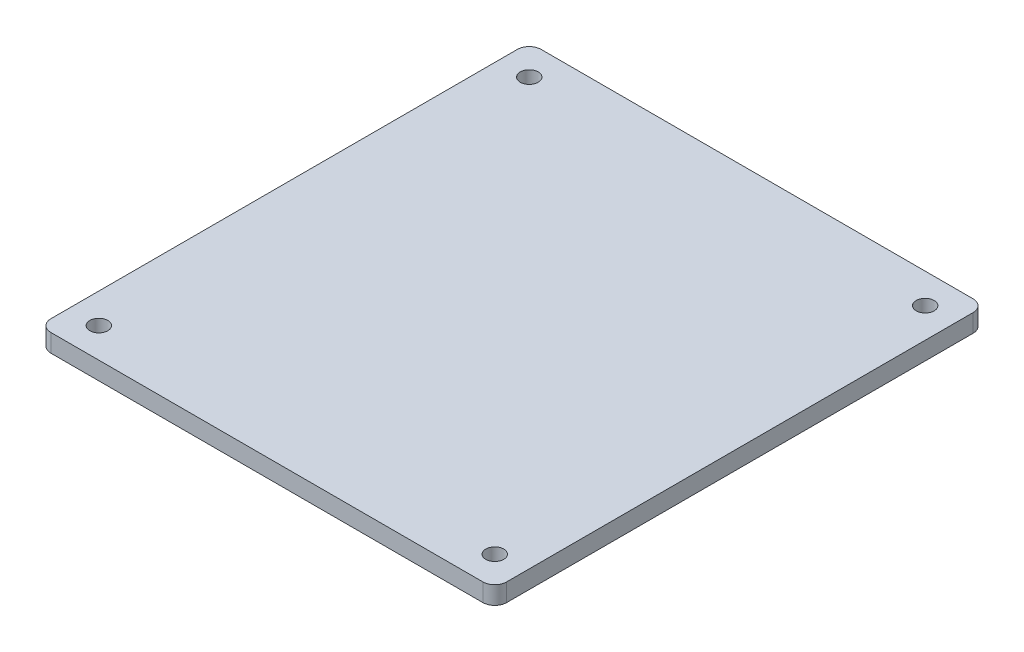
ISO-10303-21;
HEADER;
FILE_DESCRIPTION(('STEP AP214'),'2;1');
FILE_NAME('part.step','',(''),(''),'','','');
FILE_SCHEMA(('AUTOMOTIVE_DESIGN { 1 0 10303 214 1 1 1 1 }'));
ENDSEC;
DATA;
#1=APPLICATION_CONTEXT('core data for automotive mechanical design processes');
#2=APPLICATION_PROTOCOL_DEFINITION('international standard','automotive_design',2000,#1);
#3=PRODUCT_CONTEXT('',#1,'mechanical');
#4=PRODUCT('Part','Part','',(#3));
#5=PRODUCT_RELATED_PRODUCT_CATEGORY('part','',(#4));
#6=PRODUCT_DEFINITION_FORMATION('','',#4);
#7=PRODUCT_DEFINITION_CONTEXT('part definition',#1,'design');
#8=PRODUCT_DEFINITION('design','',#6,#7);
#9=PRODUCT_DEFINITION_SHAPE('','',#8);
#10=(LENGTH_UNIT() NAMED_UNIT(*) SI_UNIT(.MILLI.,.METRE.));
#11=(NAMED_UNIT(*) PLANE_ANGLE_UNIT() SI_UNIT($,.RADIAN.));
#12=(NAMED_UNIT(*) SI_UNIT($,.STERADIAN.) SOLID_ANGLE_UNIT());
#13=UNCERTAINTY_MEASURE_WITH_UNIT(LENGTH_MEASURE(1.E-05),#10,'distance_accuracy_value','');
#14=(GEOMETRIC_REPRESENTATION_CONTEXT(3) GLOBAL_UNCERTAINTY_ASSIGNED_CONTEXT((#13)) GLOBAL_UNIT_ASSIGNED_CONTEXT((#10,
#11,#12)) REPRESENTATION_CONTEXT('',''));
#15=CARTESIAN_POINT('',(0.,0.,0.));
#16=DIRECTION('',(0.,0.,1.));
#17=DIRECTION('',(1.,0.,0.));
#18=AXIS2_PLACEMENT_3D('',#15,#16,#17);
#19=CARTESIAN_POINT('',(1.5875,2.38125,-1.5875));
#20=DIRECTION('',(0.,-1.,0.));
#21=DIRECTION('',(0.,0.,-1.));
#22=AXIS2_PLACEMENT_3D('',#19,#20,#21);
#23=PLANE('',#22);
#24=CARTESIAN_POINT('',(1.5875,2.38125,-1.5875));
#25=DIRECTION('',(0.,1.,0.));
#26=DIRECTION('',(0.,0.,-1.));
#27=AXIS2_PLACEMENT_3D('',#24,#25,#26);
#28=CIRCLE('',#27,1.5875);
#29=CARTESIAN_POINT('',(0.,2.38125,-1.58750000000001));
#30=VERTEX_POINT('',#29);
#31=CARTESIAN_POINT('',(1.58750000000001,2.38125,0.));
#32=VERTEX_POINT('',#31);
#33=EDGE_CURVE('E168',#30,#32,#28,.T.);
#34=ORIENTED_EDGE('',*,*,#33,.T.);
#35=DIRECTION('',(1.,0.,0.));
#36=VECTOR('',#35,1.);
#37=CARTESIAN_POINT('',(1.58750000000001,2.38125,0.));
#38=LINE('',#37,#36);
#39=CARTESIAN_POINT('',(58.8645,2.38125,0.));
#40=VERTEX_POINT('',#39);
#41=EDGE_CURVE('E104',#32,#40,#38,.T.);
#42=ORIENTED_EDGE('',*,*,#41,.T.);
#43=CARTESIAN_POINT('',(58.8645,2.38125,-1.5875));
#44=DIRECTION('',(0.,1.,0.));
#45=DIRECTION('',(0.,0.,-1.));
#46=AXIS2_PLACEMENT_3D('',#43,#44,#45);
#47=CIRCLE('',#46,1.5875);
#48=CARTESIAN_POINT('',(60.452,2.38125,-1.58750000000001));
#49=VERTEX_POINT('',#48);
#50=EDGE_CURVE('E189',#40,#49,#47,.T.);
#51=ORIENTED_EDGE('',*,*,#50,.T.);
#52=DIRECTION('',(0.,0.,-1.));
#53=VECTOR('',#52,1.);
#54=CARTESIAN_POINT('',(60.452,2.38125,-1.58750000000001));
#55=LINE('',#54,#53);
#56=CARTESIAN_POINT('',(60.452,2.38125,-63.4365));
#57=VERTEX_POINT('',#56);
#58=EDGE_CURVE('E203',#49,#57,#55,.T.);
#59=ORIENTED_EDGE('',*,*,#58,.T.);
#60=CARTESIAN_POINT('',(58.8645,2.38125,-63.4365));
#61=DIRECTION('',(0.,1.,0.));
#62=DIRECTION('',(0.,0.,1.));
#63=AXIS2_PLACEMENT_3D('',#60,#61,#62);
#64=CIRCLE('',#63,1.5875);
#65=CARTESIAN_POINT('',(58.8645,2.38125,-65.024));
#66=VERTEX_POINT('',#65);
#67=EDGE_CURVE('E123',#57,#66,#64,.T.);
#68=ORIENTED_EDGE('',*,*,#67,.T.);
#69=DIRECTION('',(-1.,0.,0.));
#70=VECTOR('',#69,1.);
#71=CARTESIAN_POINT('',(1.58750000000001,2.38125,-65.024));
#72=LINE('',#71,#70);
#73=CARTESIAN_POINT('',(1.58750000000001,2.38125,-65.024));
#74=VERTEX_POINT('',#73);
#75=EDGE_CURVE('E117',#66,#74,#72,.T.);
#76=ORIENTED_EDGE('',*,*,#75,.T.);
#77=CARTESIAN_POINT('',(1.5875,2.38125,-63.4365));
#78=DIRECTION('',(0.,1.,0.));
#79=DIRECTION('',(0.,0.,1.));
#80=AXIS2_PLACEMENT_3D('',#77,#78,#79);
#81=CIRCLE('',#80,1.5875);
#82=CARTESIAN_POINT('',(0.,2.38125,-63.4365));
#83=VERTEX_POINT('',#82);
#84=EDGE_CURVE('E121',#74,#83,#81,.T.);
#85=ORIENTED_EDGE('',*,*,#84,.T.);
#86=DIRECTION('',(0.,0.,1.));
#87=VECTOR('',#86,1.);
#88=CARTESIAN_POINT('',(0.,2.38125,-1.58750000000001));
#89=LINE('',#88,#87);
#90=EDGE_CURVE('E61',#83,#30,#89,.T.);
#91=ORIENTED_EDGE('',*,*,#90,.T.);
#92=EDGE_LOOP('',(#34,#42,#51,#59,#68,#76,#85,#91));
#93=FACE_BOUND('',#92,.T.);
#94=CARTESIAN_POINT('',(3.96875,2.38125,-3.96875));
#95=DIRECTION('',(0.,1.,0.));
#96=DIRECTION('',(0.,0.,1.));
#97=AXIS2_PLACEMENT_3D('',#94,#95,#96);
#98=CIRCLE('',#97,1.190625);
#99=CARTESIAN_POINT('',(3.96875,2.38125,-2.778125));
#100=VERTEX_POINT('',#99);
#101=EDGE_CURVE('E150',#100,#100,#98,.T.);
#102=ORIENTED_EDGE('',*,*,#101,.F.);
#103=EDGE_LOOP('',(#102));
#104=FACE_BOUND('',#103,.T.);
#105=CARTESIAN_POINT('',(3.96875,2.38125,-61.05525));
#106=DIRECTION('',(0.,1.,0.));
#107=DIRECTION('',(0.,0.,1.));
#108=AXIS2_PLACEMENT_3D('',#105,#106,#107);
#109=CIRCLE('',#108,1.190625);
#110=CARTESIAN_POINT('',(3.96875,2.38125,-59.864625));
#111=VERTEX_POINT('',#110);
#112=EDGE_CURVE('E217',#111,#111,#109,.T.);
#113=ORIENTED_EDGE('',*,*,#112,.F.);
#114=EDGE_LOOP('',(#113));
#115=FACE_BOUND('',#114,.T.);
#116=CARTESIAN_POINT('',(56.48325,2.38125,-61.05525));
#117=DIRECTION('',(0.,1.,0.));
#118=DIRECTION('',(0.,0.,1.));
#119=AXIS2_PLACEMENT_3D('',#116,#117,#118);
#120=CIRCLE('',#119,1.190625);
#121=CARTESIAN_POINT('',(56.48325,2.38125,-59.864625));
#122=VERTEX_POINT('',#121);
#123=EDGE_CURVE('E225',#122,#122,#120,.T.);
#124=ORIENTED_EDGE('',*,*,#123,.F.);
#125=EDGE_LOOP('',(#124));
#126=FACE_BOUND('',#125,.T.);
#127=CARTESIAN_POINT('',(56.48325,2.38125,-3.96875));
#128=DIRECTION('',(0.,1.,0.));
#129=DIRECTION('',(0.,0.,1.));
#130=AXIS2_PLACEMENT_3D('',#127,#128,#129);
#131=CIRCLE('',#130,1.190625);
#132=CARTESIAN_POINT('',(56.48325,2.38125,-2.778125));
#133=VERTEX_POINT('',#132);
#134=EDGE_CURVE('E233',#133,#133,#131,.T.);
#135=ORIENTED_EDGE('',*,*,#134,.F.);
#136=EDGE_LOOP('',(#135));
#137=FACE_BOUND('',#136,.T.);
#138=ADVANCED_FACE('F43',(#93,#104,#115,#126,#137),#23,.F.);
#139=CARTESIAN_POINT('',(1.5875,0.,-1.5875));
#140=DIRECTION('',(0.,-1.,0.));
#141=DIRECTION('',(0.,0.,-1.));
#142=AXIS2_PLACEMENT_3D('',#139,#140,#141);
#143=PLANE('',#142);
#144=CARTESIAN_POINT('',(56.48325,0.,-61.05525));
#145=DIRECTION('',(0.,1.,0.));
#146=DIRECTION('',(0.,0.,1.));
#147=AXIS2_PLACEMENT_3D('',#144,#145,#146);
#148=CIRCLE('',#147,1.190625);
#149=CARTESIAN_POINT('',(56.48325,0.,-59.864625));
#150=VERTEX_POINT('',#149);
#151=EDGE_CURVE('E229',#150,#150,#148,.T.);
#152=ORIENTED_EDGE('',*,*,#151,.T.);
#153=EDGE_LOOP('',(#152));
#154=FACE_BOUND('',#153,.T.);
#155=CARTESIAN_POINT('',(3.96875,0.,-3.96875));
#156=DIRECTION('',(0.,1.,0.));
#157=DIRECTION('',(0.,0.,1.));
#158=AXIS2_PLACEMENT_3D('',#155,#156,#157);
#159=CIRCLE('',#158,1.190625);
#160=CARTESIAN_POINT('',(3.96875,0.,-2.778125));
#161=VERTEX_POINT('',#160);
#162=EDGE_CURVE('E213',#161,#161,#159,.T.);
#163=ORIENTED_EDGE('',*,*,#162,.T.);
#164=EDGE_LOOP('',(#163));
#165=FACE_BOUND('',#164,.T.);
#166=CARTESIAN_POINT('',(1.5875,0.,-1.5875));
#167=DIRECTION('',(0.,1.,0.));
#168=DIRECTION('',(0.,0.,-1.));
#169=AXIS2_PLACEMENT_3D('',#166,#167,#168);
#170=CIRCLE('',#169,1.5875);
#171=CARTESIAN_POINT('',(0.,0.,-1.58750000000001));
#172=VERTEX_POINT('',#171);
#173=CARTESIAN_POINT('',(1.58750000000001,0.,0.));
#174=VERTEX_POINT('',#173);
#175=EDGE_CURVE('E145',#172,#174,#170,.T.);
#176=ORIENTED_EDGE('',*,*,#175,.F.);
#177=DIRECTION('',(0.,0.,1.));
#178=VECTOR('',#177,1.);
#179=CARTESIAN_POINT('',(0.,0.,-1.58750000000001));
#180=LINE('',#179,#178);
#181=CARTESIAN_POINT('',(0.,0.,-63.4365));
#182=VERTEX_POINT('',#181);
#183=EDGE_CURVE('E96',#182,#172,#180,.T.);
#184=ORIENTED_EDGE('',*,*,#183,.F.);
#185=CARTESIAN_POINT('',(1.5875,0.,-63.4365));
#186=DIRECTION('',(0.,1.,0.));
#187=DIRECTION('',(0.,0.,1.));
#188=AXIS2_PLACEMENT_3D('',#185,#186,#187);
#189=CIRCLE('',#188,1.5875);
#190=CARTESIAN_POINT('',(1.58750000000001,0.,-65.024));
#191=VERTEX_POINT('',#190);
#192=EDGE_CURVE('E90',#191,#182,#189,.T.);
#193=ORIENTED_EDGE('',*,*,#192,.F.);
#194=DIRECTION('',(-1.,0.,0.));
#195=VECTOR('',#194,1.);
#196=CARTESIAN_POINT('',(1.58750000000001,0.,-65.024));
#197=LINE('',#196,#195);
#198=CARTESIAN_POINT('',(58.8645,0.,-65.024));
#199=VERTEX_POINT('',#198);
#200=EDGE_CURVE('E132',#199,#191,#197,.T.);
#201=ORIENTED_EDGE('',*,*,#200,.F.);
#202=CARTESIAN_POINT('',(58.8645,0.,-63.4365));
#203=DIRECTION('',(0.,1.,0.));
#204=DIRECTION('',(0.,0.,1.));
#205=AXIS2_PLACEMENT_3D('',#202,#203,#204);
#206=CIRCLE('',#205,1.5875);
#207=CARTESIAN_POINT('',(60.452,0.,-63.4365));
#208=VERTEX_POINT('',#207);
#209=EDGE_CURVE('E159',#208,#199,#206,.T.);
#210=ORIENTED_EDGE('',*,*,#209,.F.);
#211=DIRECTION('',(0.,0.,-1.));
#212=VECTOR('',#211,1.);
#213=CARTESIAN_POINT('',(60.452,0.,-1.58750000000001));
#214=LINE('',#213,#212);
#215=CARTESIAN_POINT('',(60.452,0.,-1.58750000000001));
#216=VERTEX_POINT('',#215);
#217=EDGE_CURVE('E156',#216,#208,#214,.T.);
#218=ORIENTED_EDGE('',*,*,#217,.F.);
#219=CARTESIAN_POINT('',(58.8645,0.,-1.5875));
#220=DIRECTION('',(0.,1.,0.));
#221=DIRECTION('',(0.,0.,-1.));
#222=AXIS2_PLACEMENT_3D('',#219,#220,#221);
#223=CIRCLE('',#222,1.5875);
#224=CARTESIAN_POINT('',(58.8645,0.,0.));
#225=VERTEX_POINT('',#224);
#226=EDGE_CURVE('E153',#225,#216,#223,.T.);
#227=ORIENTED_EDGE('',*,*,#226,.F.);
#228=DIRECTION('',(1.,0.,0.));
#229=VECTOR('',#228,1.);
#230=CARTESIAN_POINT('',(1.58750000000001,0.,0.));
#231=LINE('',#230,#229);
#232=EDGE_CURVE('E149',#174,#225,#231,.T.);
#233=ORIENTED_EDGE('',*,*,#232,.F.);
#234=EDGE_LOOP('',(#176,#184,#193,#201,#210,#218,#227,#233));
#235=FACE_BOUND('',#234,.T.);
#236=CARTESIAN_POINT('',(3.96875,0.,-61.05525));
#237=DIRECTION('',(0.,1.,0.));
#238=DIRECTION('',(0.,0.,1.));
#239=AXIS2_PLACEMENT_3D('',#236,#237,#238);
#240=CIRCLE('',#239,1.190625);
#241=CARTESIAN_POINT('',(3.96875,0.,-59.864625));
#242=VERTEX_POINT('',#241);
#243=EDGE_CURVE('E221',#242,#242,#240,.T.);
#244=ORIENTED_EDGE('',*,*,#243,.T.);
#245=EDGE_LOOP('',(#244));
#246=FACE_BOUND('',#245,.T.);
#247=CARTESIAN_POINT('',(56.48325,0.,-3.96875));
#248=DIRECTION('',(0.,1.,0.));
#249=DIRECTION('',(0.,0.,1.));
#250=AXIS2_PLACEMENT_3D('',#247,#248,#249);
#251=CIRCLE('',#250,1.190625);
#252=CARTESIAN_POINT('',(56.48325,0.,-2.778125));
#253=VERTEX_POINT('',#252);
#254=EDGE_CURVE('E237',#253,#253,#251,.T.);
#255=ORIENTED_EDGE('',*,*,#254,.T.);
#256=EDGE_LOOP('',(#255));
#257=FACE_BOUND('',#256,.T.);
#258=ADVANCED_FACE('F193',(#154,#165,#235,#246,#257),#143,.T.);
#259=CARTESIAN_POINT('',(1.5875,2.38125,-1.5875));
#260=DIRECTION('',(0.,-1.,0.));
#261=DIRECTION('',(0.,0.,-1.));
#262=AXIS2_PLACEMENT_3D('',#259,#260,#261);
#263=CYLINDRICAL_SURFACE('',#262,1.5875);
#264=ORIENTED_EDGE('',*,*,#175,.T.);
#265=DIRECTION('',(0.,-1.,0.));
#266=VECTOR('',#265,1.);
#267=CARTESIAN_POINT('',(1.58750000000001,2.38125,0.));
#268=LINE('',#267,#266);
#269=EDGE_CURVE('E11',#32,#174,#268,.T.);
#270=ORIENTED_EDGE('',*,*,#269,.F.);
#271=ORIENTED_EDGE('',*,*,#33,.F.);
#272=DIRECTION('',(0.,-1.,0.));
#273=VECTOR('',#272,1.);
#274=CARTESIAN_POINT('',(0.,2.38125,-1.58750000000001));
#275=LINE('',#274,#273);
#276=EDGE_CURVE('E141',#30,#172,#275,.T.);
#277=ORIENTED_EDGE('',*,*,#276,.T.);
#278=EDGE_LOOP('',(#264,#270,#271,#277));
#279=FACE_BOUND('',#278,.T.);
#280=ADVANCED_FACE('F45',(#279),#263,.T.);
#281=CARTESIAN_POINT('',(1.58750000000001,2.38125,0.));
#282=DIRECTION('',(0.,0.,-1.));
#283=DIRECTION('',(-1.,0.,0.));
#284=AXIS2_PLACEMENT_3D('',#281,#282,#283);
#285=PLANE('',#284);
#286=ORIENTED_EDGE('',*,*,#232,.T.);
#287=DIRECTION('',(0.,-1.,0.));
#288=VECTOR('',#287,1.);
#289=CARTESIAN_POINT('',(58.8645,2.38125,0.));
#290=LINE('',#289,#288);
#291=EDGE_CURVE('E53',#40,#225,#290,.T.);
#292=ORIENTED_EDGE('',*,*,#291,.F.);
#293=ORIENTED_EDGE('',*,*,#41,.F.);
#294=ORIENTED_EDGE('',*,*,#269,.T.);
#295=EDGE_LOOP('',(#286,#292,#293,#294));
#296=FACE_BOUND('',#295,.T.);
#297=ADVANCED_FACE('F271',(#296),#285,.F.);
#298=CARTESIAN_POINT('',(58.8645,2.38125,-1.5875));
#299=DIRECTION('',(0.,-1.,0.));
#300=DIRECTION('',(0.,0.,-1.));
#301=AXIS2_PLACEMENT_3D('',#298,#299,#300);
#302=CYLINDRICAL_SURFACE('',#301,1.5875);
#303=ORIENTED_EDGE('',*,*,#226,.T.);
#304=DIRECTION('',(0.,-1.,0.));
#305=VECTOR('',#304,1.);
#306=CARTESIAN_POINT('',(60.452,2.38125,-1.58750000000001));
#307=LINE('',#306,#305);
#308=EDGE_CURVE('E179',#49,#216,#307,.T.);
#309=ORIENTED_EDGE('',*,*,#308,.F.);
#310=ORIENTED_EDGE('',*,*,#50,.F.);
#311=ORIENTED_EDGE('',*,*,#291,.T.);
#312=EDGE_LOOP('',(#303,#309,#310,#311));
#313=FACE_BOUND('',#312,.T.);
#314=ADVANCED_FACE('F187',(#313),#302,.T.);
#315=CARTESIAN_POINT('',(60.452,2.38125,-1.58750000000001));
#316=DIRECTION('',(-1.,0.,0.));
#317=DIRECTION('',(0.,0.,1.));
#318=AXIS2_PLACEMENT_3D('',#315,#316,#317);
#319=PLANE('',#318);
#320=ORIENTED_EDGE('',*,*,#217,.T.);
#321=DIRECTION('',(0.,-1.,0.));
#322=VECTOR('',#321,1.);
#323=CARTESIAN_POINT('',(60.452,2.38125,-63.4365));
#324=LINE('',#323,#322);
#325=EDGE_CURVE('E175',#57,#208,#324,.T.);
#326=ORIENTED_EDGE('',*,*,#325,.F.);
#327=ORIENTED_EDGE('',*,*,#58,.F.);
#328=ORIENTED_EDGE('',*,*,#308,.T.);
#329=EDGE_LOOP('',(#320,#326,#327,#328));
#330=FACE_BOUND('',#329,.T.);
#331=ADVANCED_FACE('F198',(#330),#319,.F.);
#332=CARTESIAN_POINT('',(58.8645,2.38125,-63.4365));
#333=DIRECTION('',(0.,-1.,0.));
#334=DIRECTION('',(0.,0.,-1.));
#335=AXIS2_PLACEMENT_3D('',#332,#333,#334);
#336=CYLINDRICAL_SURFACE('',#335,1.5875);
#337=ORIENTED_EDGE('',*,*,#209,.T.);
#338=DIRECTION('',(0.,-1.,0.));
#339=VECTOR('',#338,1.);
#340=CARTESIAN_POINT('',(58.8645,2.38125,-65.024));
#341=LINE('',#340,#339);
#342=EDGE_CURVE('E134',#66,#199,#341,.T.);
#343=ORIENTED_EDGE('',*,*,#342,.F.);
#344=ORIENTED_EDGE('',*,*,#67,.F.);
#345=ORIENTED_EDGE('',*,*,#325,.T.);
#346=EDGE_LOOP('',(#337,#343,#344,#345));
#347=FACE_BOUND('',#346,.T.);
#348=ADVANCED_FACE('F201',(#347),#336,.T.);
#349=CARTESIAN_POINT('',(1.58750000000001,2.38125,-65.024));
#350=DIRECTION('',(0.,0.,1.));
#351=DIRECTION('',(1.,0.,0.));
#352=AXIS2_PLACEMENT_3D('',#349,#350,#351);
#353=PLANE('',#352);
#354=ORIENTED_EDGE('',*,*,#200,.T.);
#355=DIRECTION('',(0.,-1.,0.));
#356=VECTOR('',#355,1.);
#357=CARTESIAN_POINT('',(1.58750000000001,2.38125,-65.024));
#358=LINE('',#357,#356);
#359=EDGE_CURVE('E129',#74,#191,#358,.T.);
#360=ORIENTED_EDGE('',*,*,#359,.F.);
#361=ORIENTED_EDGE('',*,*,#75,.F.);
#362=ORIENTED_EDGE('',*,*,#342,.T.);
#363=EDGE_LOOP('',(#354,#360,#361,#362));
#364=FACE_BOUND('',#363,.T.);
#365=ADVANCED_FACE('F130',(#364),#353,.F.);
#366=CARTESIAN_POINT('',(1.5875,2.38125,-63.4365));
#367=DIRECTION('',(0.,-1.,0.));
#368=DIRECTION('',(0.,0.,-1.));
#369=AXIS2_PLACEMENT_3D('',#366,#367,#368);
#370=CYLINDRICAL_SURFACE('',#369,1.5875);
#371=ORIENTED_EDGE('',*,*,#192,.T.);
#372=DIRECTION('',(0.,-1.,0.));
#373=VECTOR('',#372,1.);
#374=CARTESIAN_POINT('',(0.,2.38125,-63.4365));
#375=LINE('',#374,#373);
#376=EDGE_CURVE('E135',#83,#182,#375,.T.);
#377=ORIENTED_EDGE('',*,*,#376,.F.);
#378=ORIENTED_EDGE('',*,*,#84,.F.);
#379=ORIENTED_EDGE('',*,*,#359,.T.);
#380=EDGE_LOOP('',(#371,#377,#378,#379));
#381=FACE_BOUND('',#380,.T.);
#382=ADVANCED_FACE('F137',(#381),#370,.T.);
#383=CARTESIAN_POINT('',(0.,2.38125,-1.58750000000001));
#384=DIRECTION('',(1.,0.,0.));
#385=DIRECTION('',(0.,0.,-1.));
#386=AXIS2_PLACEMENT_3D('',#383,#384,#385);
#387=PLANE('',#386);
#388=ORIENTED_EDGE('',*,*,#183,.T.);
#389=ORIENTED_EDGE('',*,*,#276,.F.);
#390=ORIENTED_EDGE('',*,*,#90,.F.);
#391=ORIENTED_EDGE('',*,*,#376,.T.);
#392=EDGE_LOOP('',(#388,#389,#390,#391));
#393=FACE_BOUND('',#392,.T.);
#394=ADVANCED_FACE('F259',(#393),#387,.F.);
#395=CARTESIAN_POINT('',(3.96875,2.38125,-3.96875));
#396=DIRECTION('',(0.,-1.,0.));
#397=DIRECTION('',(0.,0.,-1.));
#398=AXIS2_PLACEMENT_3D('',#395,#396,#397);
#399=CYLINDRICAL_SURFACE('',#398,1.190625);
#400=ORIENTED_EDGE('',*,*,#101,.T.);
#401=EDGE_LOOP('',(#400));
#402=FACE_BOUND('',#401,.T.);
#403=ORIENTED_EDGE('',*,*,#162,.F.);
#404=EDGE_LOOP('',(#403));
#405=FACE_BOUND('',#404,.T.);
#406=ADVANCED_FACE('F256',(#402,#405),#399,.F.);
#407=CARTESIAN_POINT('',(3.96875,2.38125,-61.05525));
#408=DIRECTION('',(0.,-1.,0.));
#409=DIRECTION('',(0.,0.,-1.));
#410=AXIS2_PLACEMENT_3D('',#407,#408,#409);
#411=CYLINDRICAL_SURFACE('',#410,1.190625);
#412=ORIENTED_EDGE('',*,*,#112,.T.);
#413=EDGE_LOOP('',(#412));
#414=FACE_BOUND('',#413,.T.);
#415=ORIENTED_EDGE('',*,*,#243,.F.);
#416=EDGE_LOOP('',(#415));
#417=FACE_BOUND('',#416,.T.);
#418=ADVANCED_FACE('F347',(#414,#417),#411,.F.);
#419=CARTESIAN_POINT('',(56.48325,2.38125,-61.05525));
#420=DIRECTION('',(0.,-1.,0.));
#421=DIRECTION('',(0.,0.,-1.));
#422=AXIS2_PLACEMENT_3D('',#419,#420,#421);
#423=CYLINDRICAL_SURFACE('',#422,1.190625);
#424=ORIENTED_EDGE('',*,*,#123,.T.);
#425=EDGE_LOOP('',(#424));
#426=FACE_BOUND('',#425,.T.);
#427=ORIENTED_EDGE('',*,*,#151,.F.);
#428=EDGE_LOOP('',(#427));
#429=FACE_BOUND('',#428,.T.);
#430=ADVANCED_FACE('F356',(#426,#429),#423,.F.);
#431=CARTESIAN_POINT('',(56.48325,2.38125,-3.96875));
#432=DIRECTION('',(0.,-1.,0.));
#433=DIRECTION('',(0.,0.,-1.));
#434=AXIS2_PLACEMENT_3D('',#431,#432,#433);
#435=CYLINDRICAL_SURFACE('',#434,1.190625);
#436=ORIENTED_EDGE('',*,*,#134,.T.);
#437=EDGE_LOOP('',(#436));
#438=FACE_BOUND('',#437,.T.);
#439=ORIENTED_EDGE('',*,*,#254,.F.);
#440=EDGE_LOOP('',(#439));
#441=FACE_BOUND('',#440,.T.);
#442=ADVANCED_FACE('F245',(#438,#441),#435,.F.);
#443=CLOSED_SHELL('',(#138,#258,#280,#297,#314,#331,#348,#365,#382,#394,#406,#418,#430,#442));
#444=MANIFOLD_SOLID_BREP('B2',#443);
#445=ADVANCED_BREP_SHAPE_REPRESENTATION('',(#18,#444),#14);
#446=SHAPE_DEFINITION_REPRESENTATION(#9,#445);
ENDSEC;
END-ISO-10303-21;
